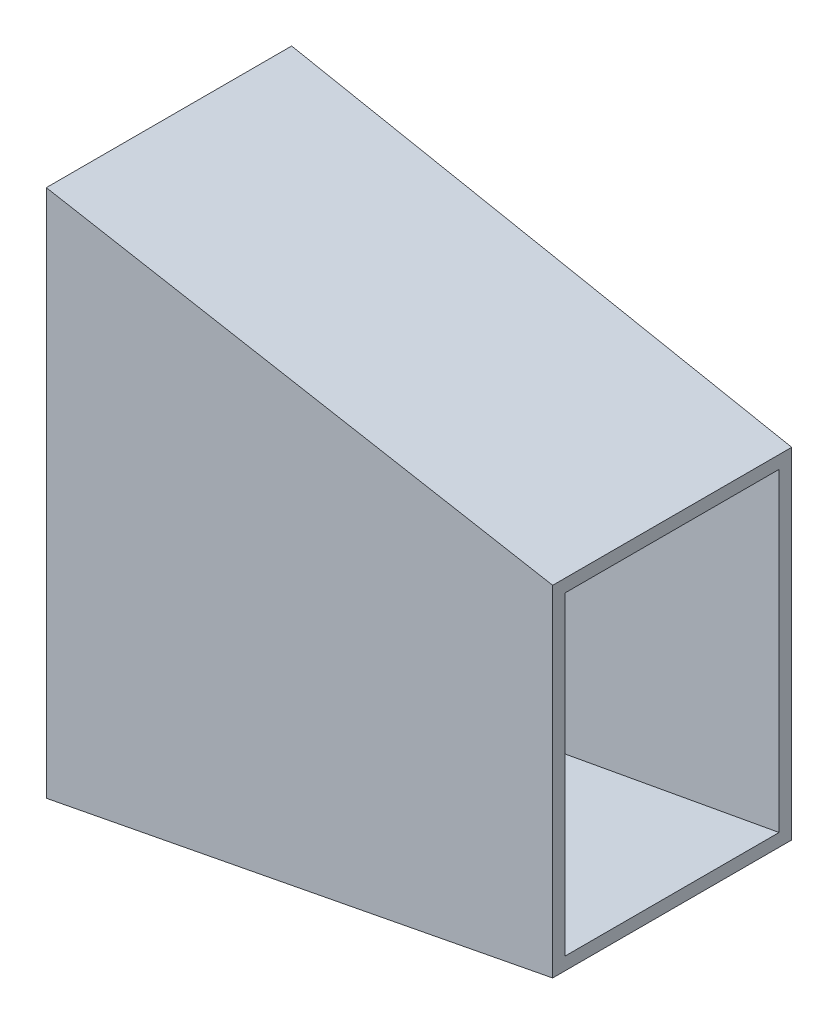
ISO-10303-21;
HEADER;
FILE_DESCRIPTION(('STEP AP214'),'2;1');
FILE_NAME('part.step','',(''),(''),'','','');
FILE_SCHEMA(('AUTOMOTIVE_DESIGN { 1 0 10303 214 1 1 1 1 }'));
ENDSEC;
DATA;
#1=APPLICATION_CONTEXT('core data for automotive mechanical design processes');
#2=APPLICATION_PROTOCOL_DEFINITION('international standard','automotive_design',2000,#1);
#3=PRODUCT_CONTEXT('',#1,'mechanical');
#4=PRODUCT('Part','Part','',(#3));
#5=PRODUCT_RELATED_PRODUCT_CATEGORY('part','',(#4));
#6=PRODUCT_DEFINITION_FORMATION('','',#4);
#7=PRODUCT_DEFINITION_CONTEXT('part definition',#1,'design');
#8=PRODUCT_DEFINITION('design','',#6,#7);
#9=PRODUCT_DEFINITION_SHAPE('','',#8);
#10=(LENGTH_UNIT() NAMED_UNIT(*) SI_UNIT(.MILLI.,.METRE.));
#11=(NAMED_UNIT(*) PLANE_ANGLE_UNIT() SI_UNIT($,.RADIAN.));
#12=(NAMED_UNIT(*) SI_UNIT($,.STERADIAN.) SOLID_ANGLE_UNIT());
#13=UNCERTAINTY_MEASURE_WITH_UNIT(LENGTH_MEASURE(1.E-05),#10,'distance_accuracy_value','');
#14=(GEOMETRIC_REPRESENTATION_CONTEXT(3) GLOBAL_UNCERTAINTY_ASSIGNED_CONTEXT((#13)) GLOBAL_UNIT_ASSIGNED_CONTEXT((#10,
#11,#12)) REPRESENTATION_CONTEXT('',''));
#15=CARTESIAN_POINT('',(0.,0.,0.));
#16=DIRECTION('',(0.,0.,1.));
#17=DIRECTION('',(1.,0.,0.));
#18=AXIS2_PLACEMENT_3D('',#15,#16,#17);
#19=CARTESIAN_POINT('',(800.000000000001,250.,-169.999999999994));
#20=DIRECTION('',(0.0062498779332704,0.,-0.999980469322186));
#21=DIRECTION('',(0.,-1.,0.));
#22=AXIS2_PLACEMENT_3D('',#19,#20,#21);
#23=PLANE('',#22);
#24=DIRECTION('',(-0.982853642700913,0.184285058006421,-0.00614283526688735));
#25=VECTOR('',#24,1.);
#26=CARTESIAN_POINT('',(400.000000000001,325.,-172.499999999997));
#27=LINE('',#26,#25);
#28=CARTESIAN_POINT('',(800.000000000001,250.,-169.999999999994));
#29=VERTEX_POINT('',#28);
#30=CARTESIAN_POINT('',(9.99999999999995,398.125,-174.9375));
#31=VERTEX_POINT('',#30);
#32=EDGE_CURVE('E411',#29,#31,#27,.T.);
#33=ORIENTED_EDGE('',*,*,#32,.T.);
#34=DIRECTION('',(0.,-1.,0.));
#35=VECTOR('',#34,1.);
#36=CARTESIAN_POINT('',(10.,250.,-174.9375));
#37=LINE('',#36,#35);
#38=CARTESIAN_POINT('',(10.,380.348525745124,-174.9375));
#39=VERTEX_POINT('',#38);
#40=EDGE_CURVE('E408',#31,#39,#37,.T.);
#41=ORIENTED_EDGE('',*,*,#40,.T.);
#42=CARTESIAN_POINT('',(10.,170.348525745124,-174.9375));
#43=VERTEX_POINT('',#42);
#44=EDGE_CURVE('E412',#39,#43,#37,.T.);
#45=ORIENTED_EDGE('',*,*,#44,.T.);
#46=CARTESIAN_POINT('',(10.,145.,-174.9375));
#47=VERTEX_POINT('',#46);
#48=EDGE_CURVE('E817',#43,#47,#37,.T.);
#49=ORIENTED_EDGE('',*,*,#48,.T.);
#50=CARTESIAN_POINT('',(10.,-145.,-174.9375));
#51=VERTEX_POINT('',#50);
#52=EDGE_CURVE('E816',#47,#51,#37,.T.);
#53=ORIENTED_EDGE('',*,*,#52,.T.);
#54=CARTESIAN_POINT('',(10.,-170.348525745124,-174.9375));
#55=VERTEX_POINT('',#54);
#56=EDGE_CURVE('E815',#51,#55,#37,.T.);
#57=ORIENTED_EDGE('',*,*,#56,.T.);
#58=CARTESIAN_POINT('',(10.,-380.348525745124,-174.9375));
#59=VERTEX_POINT('',#58);
#60=EDGE_CURVE('E800',#55,#59,#37,.T.);
#61=ORIENTED_EDGE('',*,*,#60,.T.);
#62=CARTESIAN_POINT('',(9.99999999999998,-398.125,-174.9375));
#63=VERTEX_POINT('',#62);
#64=EDGE_CURVE('E407',#59,#63,#37,.T.);
#65=ORIENTED_EDGE('',*,*,#64,.T.);
#66=DIRECTION('',(-0.982853642700913,-0.184285058006421,-0.00614283526688756));
#67=VECTOR('',#66,1.);
#68=CARTESIAN_POINT('',(400.000000000001,-325.,-172.499999999997));
#69=LINE('',#68,#67);
#70=CARTESIAN_POINT('',(800.000000000001,-250.,-169.999999999994));
#71=VERTEX_POINT('',#70);
#72=EDGE_CURVE('E417',#71,#63,#69,.T.);
#73=ORIENTED_EDGE('',*,*,#72,.F.);
#74=DIRECTION('',(0.,-1.,0.));
#75=VECTOR('',#74,1.);
#76=CARTESIAN_POINT('',(800.000000000001,0.,-169.999999999994));
#77=LINE('',#76,#75);
#78=EDGE_CURVE('E413',#29,#71,#77,.T.);
#79=ORIENTED_EDGE('',*,*,#78,.F.);
#80=EDGE_LOOP('',(#33,#41,#45,#49,#53,#57,#61,#65,#73,#79));
#81=FACE_BOUND('',#80,.T.);
#82=DIRECTION('',(0.,1.,0.));
#83=VECTOR('',#82,1.);
#84=CARTESIAN_POINT('',(431.474072205954,100.,-172.30328704871));
#85=LINE('',#84,#83);
#86=CARTESIAN_POINT('',(431.474072205954,-100.,-172.30328704871));
#87=VERTEX_POINT('',#86);
#88=CARTESIAN_POINT('',(431.474072205954,100.,-172.30328704871));
#89=VERTEX_POINT('',#88);
#90=EDGE_CURVE('E291',#87,#89,#85,.T.);
#91=ORIENTED_EDGE('',*,*,#90,.F.);
#92=DIRECTION('',(0.999980469322186,0.,0.00624987793327036));
#93=VECTOR('',#92,1.);
#94=CARTESIAN_POINT('',(371.475244046623,-100.,-172.678279724706));
#95=LINE('',#94,#93);
#96=CARTESIAN_POINT('',(371.475244046625,-100.,-172.678279724706));
#97=VERTEX_POINT('',#96);
#98=EDGE_CURVE('E288',#97,#87,#95,.T.);
#99=ORIENTED_EDGE('',*,*,#98,.F.);
#100=DIRECTION('',(0.,-1.,0.));
#101=VECTOR('',#100,1.);
#102=CARTESIAN_POINT('',(371.475244046623,100.,-172.678279724706));
#103=LINE('',#102,#101);
#104=CARTESIAN_POINT('',(371.475244046623,100.,-172.678279724706));
#105=VERTEX_POINT('',#104);
#106=EDGE_CURVE('E112',#105,#97,#103,.T.);
#107=ORIENTED_EDGE('',*,*,#106,.F.);
#108=DIRECTION('',(-0.999980469322186,0.,-0.00624987793327036));
#109=VECTOR('',#108,1.);
#110=CARTESIAN_POINT('',(371.475244046623,100.,-172.678279724706));
#111=LINE('',#110,#109);
#112=EDGE_CURVE('E107',#89,#105,#111,.T.);
#113=ORIENTED_EDGE('',*,*,#112,.F.);
#114=EDGE_LOOP('',(#91,#99,#107,#113));
#115=FACE_BOUND('',#114,.T.);
#116=ADVANCED_FACE('F92',(#81,#115),#23,.F.);
#117=CARTESIAN_POINT('',(0.,0.,0.));
#118=DIRECTION('',(-1.,0.,0.));
#119=DIRECTION('',(0.,0.,1.));
#120=AXIS2_PLACEMENT_3D('',#117,#118,#119);
#121=PLANE('',#120);
#122=DIRECTION('',(0.,-1.,0.));
#123=VECTOR('',#122,1.);
#124=CARTESIAN_POINT('',(0.,0.,-195.000390621185));
#125=LINE('',#124,#123);
#126=CARTESIAN_POINT('',(0.,420.348525745125,-195.000390621185));
#127=VERTEX_POINT('',#126);
#128=CARTESIAN_POINT('',(0.,-420.348525745125,-195.000390621185));
#129=VERTEX_POINT('',#128);
#130=EDGE_CURVE('E445',#127,#129,#125,.T.);
#131=ORIENTED_EDGE('',*,*,#130,.T.);
#132=DIRECTION('',(0.,0.,1.));
#133=VECTOR('',#132,1.);
#134=CARTESIAN_POINT('',(0.,-420.348525745124,5.66193389133556E-13));
#135=LINE('',#134,#133);
#136=CARTESIAN_POINT('',(0.,-420.348525745124,195.000390621185));
#137=VERTEX_POINT('',#136);
#138=EDGE_CURVE('E462',#129,#137,#135,.T.);
#139=ORIENTED_EDGE('',*,*,#138,.T.);
#140=DIRECTION('',(0.,1.,0.));
#141=VECTOR('',#140,1.);
#142=CARTESIAN_POINT('',(0.,0.,195.000390621185));
#143=LINE('',#142,#141);
#144=CARTESIAN_POINT('',(0.,420.348525745125,195.000390621185));
#145=VERTEX_POINT('',#144);
#146=EDGE_CURVE('E465',#137,#145,#143,.T.);
#147=ORIENTED_EDGE('',*,*,#146,.T.);
#148=DIRECTION('',(0.,0.,-1.));
#149=VECTOR('',#148,1.);
#150=CARTESIAN_POINT('',(0.,420.348525745125,5.66193389133559E-13));
#151=LINE('',#150,#149);
#152=EDGE_CURVE('E416',#145,#127,#151,.T.);
#153=ORIENTED_EDGE('',*,*,#152,.T.);
#154=EDGE_LOOP('',(#131,#139,#147,#153));
#155=FACE_BOUND('',#154,.T.);
#156=DIRECTION('',(0.,1.,0.));
#157=VECTOR('',#156,1.);
#158=CARTESIAN_POINT('',(0.,145.,-180.));
#159=LINE('',#158,#157);
#160=CARTESIAN_POINT('',(0.,-145.,-180.));
#161=VERTEX_POINT('',#160);
#162=CARTESIAN_POINT('',(0.,145.,-180.));
#163=VERTEX_POINT('',#162);
#164=EDGE_CURVE('E391',#161,#163,#159,.T.);
#165=ORIENTED_EDGE('',*,*,#164,.T.);
#166=DIRECTION('',(0.,0.,1.));
#167=VECTOR('',#166,1.);
#168=CARTESIAN_POINT('',(0.,145.,20.));
#169=LINE('',#168,#167);
#170=CARTESIAN_POINT('',(0.,145.,20.));
#171=VERTEX_POINT('',#170);
#172=EDGE_CURVE('E292',#163,#171,#169,.T.);
#173=ORIENTED_EDGE('',*,*,#172,.T.);
#174=DIRECTION('',(0.,-1.,0.));
#175=VECTOR('',#174,1.);
#176=CARTESIAN_POINT('',(0.,-145.,20.));
#177=LINE('',#176,#175);
#178=CARTESIAN_POINT('',(0.,-145.,20.));
#179=VERTEX_POINT('',#178);
#180=EDGE_CURVE('E295',#171,#179,#177,.T.);
#181=ORIENTED_EDGE('',*,*,#180,.T.);
#182=DIRECTION('',(0.,0.,-1.));
#183=VECTOR('',#182,1.);
#184=CARTESIAN_POINT('',(0.,-145.,-180.));
#185=LINE('',#184,#183);
#186=EDGE_CURVE('E388',#179,#161,#185,.T.);
#187=ORIENTED_EDGE('',*,*,#186,.T.);
#188=EDGE_LOOP('',(#165,#173,#181,#187));
#189=FACE_BOUND('',#188,.T.);
#190=DIRECTION('',(0.,0.,-1.));
#191=VECTOR('',#190,1.);
#192=CARTESIAN_POINT('',(0.,170.348525745124,-180.));
#193=LINE('',#192,#191);
#194=CARTESIAN_POINT('',(0.,170.348525745124,-40.));
#195=VERTEX_POINT('',#194);
#196=CARTESIAN_POINT('',(0.,170.348525745124,-180.));
#197=VERTEX_POINT('',#196);
#198=EDGE_CURVE('E340',#195,#197,#193,.T.);
#199=ORIENTED_EDGE('',*,*,#198,.T.);
#200=DIRECTION('',(0.,1.,0.));
#201=VECTOR('',#200,1.);
#202=CARTESIAN_POINT('',(0.,170.348525745124,-180.));
#203=LINE('',#202,#201);
#204=CARTESIAN_POINT('',(0.,380.348525745124,-180.));
#205=VERTEX_POINT('',#204);
#206=EDGE_CURVE('E352',#197,#205,#203,.T.);
#207=ORIENTED_EDGE('',*,*,#206,.T.);
#208=DIRECTION('',(0.,0.,1.));
#209=VECTOR('',#208,1.);
#210=CARTESIAN_POINT('',(0.,380.348525745124,-180.));
#211=LINE('',#210,#209);
#212=CARTESIAN_POINT('',(0.,380.348525745124,-39.9999999999996));
#213=VERTEX_POINT('',#212);
#214=EDGE_CURVE('E355',#205,#213,#211,.T.);
#215=ORIENTED_EDGE('',*,*,#214,.T.);
#216=DIRECTION('',(0.,-1.,0.));
#217=VECTOR('',#216,1.);
#218=CARTESIAN_POINT('',(0.,170.348525745124,-40.));
#219=LINE('',#218,#217);
#220=EDGE_CURVE('E359',#213,#195,#219,.T.);
#221=ORIENTED_EDGE('',*,*,#220,.T.);
#222=EDGE_LOOP('',(#199,#207,#215,#221));
#223=FACE_BOUND('',#222,.T.);
#224=DIRECTION('',(0.,0.,1.));
#225=VECTOR('',#224,1.);
#226=CARTESIAN_POINT('',(0.,-170.348525745124,-180.));
#227=LINE('',#226,#225);
#228=CARTESIAN_POINT('',(0.,-170.348525745124,-180.));
#229=VERTEX_POINT('',#228);
#230=CARTESIAN_POINT('',(0.,-170.348525745124,-40.0000000000001));
#231=VERTEX_POINT('',#230);
#232=EDGE_CURVE('E304',#229,#231,#227,.T.);
#233=ORIENTED_EDGE('',*,*,#232,.T.);
#234=DIRECTION('',(0.,-1.,0.));
#235=VECTOR('',#234,1.);
#236=CARTESIAN_POINT('',(0.,-170.348525745124,-40.0000000000001));
#237=LINE('',#236,#235);
#238=CARTESIAN_POINT('',(0.,-380.348525745124,-40.0000000000001));
#239=VERTEX_POINT('',#238);
#240=EDGE_CURVE('E314',#231,#239,#237,.T.);
#241=ORIENTED_EDGE('',*,*,#240,.T.);
#242=DIRECTION('',(0.,0.,-1.));
#243=VECTOR('',#242,1.);
#244=CARTESIAN_POINT('',(0.,-380.348525745124,-180.));
#245=LINE('',#244,#243);
#246=CARTESIAN_POINT('',(0.,-380.348525745124,-180.));
#247=VERTEX_POINT('',#246);
#248=EDGE_CURVE('E317',#239,#247,#245,.T.);
#249=ORIENTED_EDGE('',*,*,#248,.T.);
#250=DIRECTION('',(0.,1.,0.));
#251=VECTOR('',#250,1.);
#252=CARTESIAN_POINT('',(0.,-170.348525745124,-180.));
#253=LINE('',#252,#251);
#254=EDGE_CURVE('E321',#247,#229,#253,.T.);
#255=ORIENTED_EDGE('',*,*,#254,.T.);
#256=EDGE_LOOP('',(#233,#241,#249,#255));
#257=FACE_BOUND('',#256,.T.);
#258=ADVANCED_FACE('F469',(#155,#189,#223,#257),#121,.T.);
#259=CARTESIAN_POINT('',(800.124997558667,250.,-189.999609386438));
#260=DIRECTION('',(0.0062498779332704,0.,-0.999980469322186));
#261=DIRECTION('',(0.,-1.,0.));
#262=AXIS2_PLACEMENT_3D('',#259,#260,#261);
#263=PLANE('',#262);
#264=DIRECTION('',(0.,-1.,0.));
#265=VECTOR('',#264,1.);
#266=CARTESIAN_POINT('',(800.000000000001,0.,-190.00039062118));
#267=LINE('',#266,#265);
#268=CARTESIAN_POINT('',(800.000000000001,270.348525745125,-190.00039062118));
#269=VERTEX_POINT('',#268);
#270=CARTESIAN_POINT('',(800.000000000001,-270.348525745125,-190.00039062118));
#271=VERTEX_POINT('',#270);
#272=EDGE_CURVE('E100',#269,#271,#267,.T.);
#273=ORIENTED_EDGE('',*,*,#272,.T.);
#274=DIRECTION('',(-0.982853642700913,-0.184285058006421,-0.00614283526688731));
#275=VECTOR('',#274,1.);
#276=CARTESIAN_POINT('',(894.369004417796,-252.654337416788,-189.410584343568));
#277=LINE('',#276,#275);
#278=EDGE_CURVE('E437',#271,#129,#277,.T.);
#279=ORIENTED_EDGE('',*,*,#278,.T.);
#280=ORIENTED_EDGE('',*,*,#130,.F.);
#281=DIRECTION('',(-0.982853642700913,0.184285058006422,-0.00614283526688735));
#282=VECTOR('',#281,1.);
#283=CARTESIAN_POINT('',(805.859136865628,269.24993758282,-189.96377101577));
#284=LINE('',#283,#282);
#285=EDGE_CURVE('E441',#269,#127,#284,.T.);
#286=ORIENTED_EDGE('',*,*,#285,.F.);
#287=EDGE_LOOP('',(#273,#279,#280,#286));
#288=FACE_BOUND('',#287,.T.);
#289=ADVANCED_FACE('F475',(#288),#263,.T.);
#290=CARTESIAN_POINT('',(803.685770701005,-269.657443738686,-169.999999999994));
#291=DIRECTION('',(0.184288535050185,-0.982872186934322,0.));
#292=DIRECTION('',(0.,0.,1.));
#293=AXIS2_PLACEMENT_3D('',#290,#291,#292);
#294=PLANE('',#293);
#295=DIRECTION('',(0.,0.,1.));
#296=VECTOR('',#295,1.);
#297=CARTESIAN_POINT('',(800.,-270.348525745125,5.74703683335375E-12));
#298=LINE('',#297,#296);
#299=CARTESIAN_POINT('',(799.999999999999,-270.348525745125,190.000390621191));
#300=VERTEX_POINT('',#299);
#301=EDGE_CURVE('E440',#271,#300,#298,.T.);
#302=ORIENTED_EDGE('',*,*,#301,.T.);
#303=DIRECTION('',(-0.982853642700913,-0.184285058006421,0.0061428352668738));
#304=VECTOR('',#303,1.);
#305=CARTESIAN_POINT('',(805.859136865626,-269.249937582819,189.963771015781));
#306=LINE('',#305,#304);
#307=EDGE_CURVE('E446',#300,#137,#306,.T.);
#308=ORIENTED_EDGE('',*,*,#307,.T.);
#309=ORIENTED_EDGE('',*,*,#138,.F.);
#310=ORIENTED_EDGE('',*,*,#278,.F.);
#311=EDGE_LOOP('',(#302,#308,#309,#310));
#312=FACE_BOUND('',#311,.T.);
#313=ADVANCED_FACE('F481',(#312),#294,.T.);
#314=CARTESIAN_POINT('',(800.124997558664,-250.,189.999609386449));
#315=DIRECTION('',(0.00624987793325661,0.,0.999980469322186));
#316=DIRECTION('',(0.,1.,0.));
#317=AXIS2_PLACEMENT_3D('',#314,#315,#316);
#318=PLANE('',#317);
#319=DIRECTION('',(0.,1.,0.));
#320=VECTOR('',#319,1.);
#321=CARTESIAN_POINT('',(799.999999999999,0.,190.000390621191));
#322=LINE('',#321,#320);
#323=CARTESIAN_POINT('',(799.999999999999,270.348525745125,190.000390621191));
#324=VERTEX_POINT('',#323);
#325=EDGE_CURVE('E449',#300,#324,#322,.T.);
#326=ORIENTED_EDGE('',*,*,#325,.T.);
#327=DIRECTION('',(-0.982853642700913,0.184285058006422,0.00614283526687376));
#328=VECTOR('',#327,1.);
#329=CARTESIAN_POINT('',(894.369004417794,252.654337416788,189.41058434358));
#330=LINE('',#329,#328);
#331=EDGE_CURVE('E450',#324,#145,#330,.T.);
#332=ORIENTED_EDGE('',*,*,#331,.T.);
#333=ORIENTED_EDGE('',*,*,#146,.F.);
#334=ORIENTED_EDGE('',*,*,#307,.F.);
#335=EDGE_LOOP('',(#326,#332,#333,#334));
#336=FACE_BOUND('',#335,.T.);
#337=ADVANCED_FACE('F484',(#336),#318,.T.);
#338=CARTESIAN_POINT('',(803.685770701003,269.657443738686,170.000000000006));
#339=DIRECTION('',(0.184288535050186,0.982872186934322,0.));
#340=DIRECTION('',(0.,0.,-1.));
#341=AXIS2_PLACEMENT_3D('',#338,#339,#340);
#342=PLANE('',#341);
#343=DIRECTION('',(0.,0.,-1.));
#344=VECTOR('',#343,1.);
#345=CARTESIAN_POINT('',(800.,270.348525745125,5.74703683335375E-12));
#346=LINE('',#345,#344);
#347=EDGE_CURVE('E444',#324,#269,#346,.T.);
#348=ORIENTED_EDGE('',*,*,#347,.T.);
#349=ORIENTED_EDGE('',*,*,#285,.T.);
#350=ORIENTED_EDGE('',*,*,#152,.F.);
#351=ORIENTED_EDGE('',*,*,#331,.F.);
#352=EDGE_LOOP('',(#348,#349,#350,#351));
#353=FACE_BOUND('',#352,.T.);
#354=ADVANCED_FACE('F94',(#353),#342,.T.);
#355=CARTESIAN_POINT('',(800.,0.,5.74703683335375E-12));
#356=DIRECTION('',(-1.,0.,0.));
#357=DIRECTION('',(0.,0.,1.));
#358=AXIS2_PLACEMENT_3D('',#355,#356,#357);
#359=PLANE('',#358);
#360=DIRECTION('',(0.,1.,0.));
#361=VECTOR('',#360,1.);
#362=CARTESIAN_POINT('',(799.999999999999,0.,170.000000000006));
#363=LINE('',#362,#361);
#364=CARTESIAN_POINT('',(799.999999999999,-250.,170.000000000006));
#365=VERTEX_POINT('',#364);
#366=CARTESIAN_POINT('',(799.999999999999,250.,170.000000000006));
#367=VERTEX_POINT('',#366);
#368=EDGE_CURVE('E426',#365,#367,#363,.T.);
#369=ORIENTED_EDGE('',*,*,#368,.T.);
#370=DIRECTION('',(0.,0.,-1.));
#371=VECTOR('',#370,1.);
#372=CARTESIAN_POINT('',(800.,250.,5.55111512312578E-12));
#373=LINE('',#372,#371);
#374=EDGE_CURVE('E432',#367,#29,#373,.T.);
#375=ORIENTED_EDGE('',*,*,#374,.T.);
#376=ORIENTED_EDGE('',*,*,#78,.T.);
#377=DIRECTION('',(0.,0.,1.));
#378=VECTOR('',#377,1.);
#379=CARTESIAN_POINT('',(800.,-250.,5.60662627435704E-12));
#380=LINE('',#379,#378);
#381=EDGE_CURVE('E420',#71,#365,#380,.T.);
#382=ORIENTED_EDGE('',*,*,#381,.T.);
#383=EDGE_LOOP('',(#369,#375,#376,#382));
#384=FACE_BOUND('',#383,.T.);
#385=ORIENTED_EDGE('',*,*,#347,.F.);
#386=ORIENTED_EDGE('',*,*,#325,.F.);
#387=ORIENTED_EDGE('',*,*,#301,.F.);
#388=ORIENTED_EDGE('',*,*,#272,.F.);
#389=EDGE_LOOP('',(#385,#386,#387,#388));
#390=FACE_BOUND('',#389,.T.);
#391=ADVANCED_FACE('F479',(#384,#390),#359,.F.);
#392=CARTESIAN_POINT('',(800.000000000001,-250.,-169.999999999994));
#393=DIRECTION('',(0.184288535050185,-0.982872186934322,0.));
#394=DIRECTION('',(0.,0.,1.));
#395=AXIS2_PLACEMENT_3D('',#392,#393,#394);
#396=PLANE('',#395);
#397=ORIENTED_EDGE('',*,*,#72,.T.);
#398=DIRECTION('',(0.,0.,1.));
#399=VECTOR('',#398,1.);
#400=CARTESIAN_POINT('',(10.,-398.125,-169.999999999994));
#401=LINE('',#400,#399);
#402=CARTESIAN_POINT('',(9.99999999999998,-398.125,174.9375));
#403=VERTEX_POINT('',#402);
#404=EDGE_CURVE('E404',#63,#403,#401,.T.);
#405=ORIENTED_EDGE('',*,*,#404,.T.);
#406=DIRECTION('',(-0.982853642700913,-0.184285058006421,0.0061428352668738));
#407=VECTOR('',#406,1.);
#408=CARTESIAN_POINT('',(399.999999999999,-325.,172.500000000003));
#409=LINE('',#408,#407);
#410=EDGE_CURVE('E423',#365,#403,#409,.T.);
#411=ORIENTED_EDGE('',*,*,#410,.F.);
#412=ORIENTED_EDGE('',*,*,#381,.F.);
#413=EDGE_LOOP('',(#397,#405,#411,#412));
#414=FACE_BOUND('',#413,.T.);
#415=ADVANCED_FACE('F502',(#414),#396,.F.);
#416=CARTESIAN_POINT('',(799.999999999999,-250.,170.000000000006));
#417=DIRECTION('',(0.00624987793325661,0.,0.999980469322186));
#418=DIRECTION('',(0.,1.,0.));
#419=AXIS2_PLACEMENT_3D('',#416,#417,#418);
#420=PLANE('',#419);
#421=ORIENTED_EDGE('',*,*,#410,.T.);
#422=DIRECTION('',(0.,1.,0.));
#423=VECTOR('',#422,1.);
#424=CARTESIAN_POINT('',(10.,-250.,174.9375));
#425=LINE('',#424,#423);
#426=CARTESIAN_POINT('',(9.99999999999998,398.125,174.9375));
#427=VERTEX_POINT('',#426);
#428=EDGE_CURVE('E335',#403,#427,#425,.T.);
#429=ORIENTED_EDGE('',*,*,#428,.T.);
#430=DIRECTION('',(-0.982853642700913,0.184285058006422,0.006142835266874));
#431=VECTOR('',#430,1.);
#432=CARTESIAN_POINT('',(399.999999999999,325.,172.500000000003));
#433=LINE('',#432,#431);
#434=EDGE_CURVE('E429',#367,#427,#433,.T.);
#435=ORIENTED_EDGE('',*,*,#434,.F.);
#436=ORIENTED_EDGE('',*,*,#368,.F.);
#437=EDGE_LOOP('',(#421,#429,#435,#436));
#438=FACE_BOUND('',#437,.T.);
#439=ADVANCED_FACE('F505',(#438),#420,.F.);
#440=CARTESIAN_POINT('',(799.999999999999,250.,170.000000000006));
#441=DIRECTION('',(0.184288535050186,0.982872186934322,0.));
#442=DIRECTION('',(0.,0.,-1.));
#443=AXIS2_PLACEMENT_3D('',#440,#441,#442);
#444=PLANE('',#443);
#445=ORIENTED_EDGE('',*,*,#434,.T.);
#446=DIRECTION('',(0.,0.,-1.));
#447=VECTOR('',#446,1.);
#448=CARTESIAN_POINT('',(10.,398.125,170.000000000006));
#449=LINE('',#448,#447);
#450=EDGE_CURVE('E12',#427,#31,#449,.T.);
#451=ORIENTED_EDGE('',*,*,#450,.T.);
#452=ORIENTED_EDGE('',*,*,#32,.F.);
#453=ORIENTED_EDGE('',*,*,#374,.F.);
#454=EDGE_LOOP('',(#445,#451,#452,#453));
#455=FACE_BOUND('',#454,.T.);
#456=ADVANCED_FACE('F509',(#455),#444,.F.);
#457=CARTESIAN_POINT('',(10.,0.,0.));
#458=DIRECTION('',(1.,0.,0.));
#459=DIRECTION('',(0.,0.,-1.));
#460=AXIS2_PLACEMENT_3D('',#457,#458,#459);
#461=PLANE('',#460);
#462=DIRECTION('',(0.,0.,-1.));
#463=VECTOR('',#462,1.);
#464=CARTESIAN_POINT('',(10.,-380.348525745124,-180.));
#465=LINE('',#464,#463);
#466=CARTESIAN_POINT('',(10.,-380.348525745124,-40.0000000000001));
#467=VERTEX_POINT('',#466);
#468=EDGE_CURVE('E305',#467,#59,#465,.T.);
#469=ORIENTED_EDGE('',*,*,#468,.F.);
#470=DIRECTION('',(0.,-1.,0.));
#471=VECTOR('',#470,1.);
#472=CARTESIAN_POINT('',(10.,-170.348525745124,-40.0000000000001));
#473=LINE('',#472,#471);
#474=CARTESIAN_POINT('',(10.,-170.348525745124,-40.0000000000001));
#475=VERTEX_POINT('',#474);
#476=EDGE_CURVE('E301',#475,#467,#473,.T.);
#477=ORIENTED_EDGE('',*,*,#476,.F.);
#478=DIRECTION('',(0.,0.,1.));
#479=VECTOR('',#478,1.);
#480=CARTESIAN_POINT('',(10.,-170.348525745124,-180.));
#481=LINE('',#480,#479);
#482=EDGE_CURVE('E310',#55,#475,#481,.T.);
#483=ORIENTED_EDGE('',*,*,#482,.F.);
#484=ORIENTED_EDGE('',*,*,#56,.F.);
#485=DIRECTION('',(0.,0.,-1.));
#486=VECTOR('',#485,1.);
#487=CARTESIAN_POINT('',(10.,-145.,-180.));
#488=LINE('',#487,#486);
#489=CARTESIAN_POINT('',(10.,-145.,20.));
#490=VERTEX_POINT('',#489);
#491=EDGE_CURVE('E380',#490,#51,#488,.T.);
#492=ORIENTED_EDGE('',*,*,#491,.F.);
#493=DIRECTION('',(0.,-1.,0.));
#494=VECTOR('',#493,1.);
#495=CARTESIAN_POINT('',(10.,-145.,20.));
#496=LINE('',#495,#494);
#497=CARTESIAN_POINT('',(10.,145.,20.));
#498=VERTEX_POINT('',#497);
#499=EDGE_CURVE('E375',#498,#490,#496,.T.);
#500=ORIENTED_EDGE('',*,*,#499,.F.);
#501=DIRECTION('',(0.,0.,1.));
#502=VECTOR('',#501,1.);
#503=CARTESIAN_POINT('',(10.,145.,20.));
#504=LINE('',#503,#502);
#505=EDGE_CURVE('E376',#47,#498,#504,.T.);
#506=ORIENTED_EDGE('',*,*,#505,.F.);
#507=ORIENTED_EDGE('',*,*,#48,.F.);
#508=DIRECTION('',(0.,0.,-1.));
#509=VECTOR('',#508,1.);
#510=CARTESIAN_POINT('',(10.,170.348525745124,-180.));
#511=LINE('',#510,#509);
#512=CARTESIAN_POINT('',(10.,170.348525745124,-40.));
#513=VERTEX_POINT('',#512);
#514=EDGE_CURVE('E348',#513,#43,#511,.T.);
#515=ORIENTED_EDGE('',*,*,#514,.F.);
#516=DIRECTION('',(0.,-1.,0.));
#517=VECTOR('',#516,1.);
#518=CARTESIAN_POINT('',(10.,170.348525745124,-40.));
#519=LINE('',#518,#517);
#520=CARTESIAN_POINT('',(10.,380.348525745124,-39.9999999999996));
#521=VERTEX_POINT('',#520);
#522=EDGE_CURVE('E344',#521,#513,#519,.T.);
#523=ORIENTED_EDGE('',*,*,#522,.F.);
#524=DIRECTION('',(0.,0.,1.));
#525=VECTOR('',#524,1.);
#526=CARTESIAN_POINT('',(10.,380.348525745124,-180.));
#527=LINE('',#526,#525);
#528=EDGE_CURVE('E339',#39,#521,#527,.T.);
#529=ORIENTED_EDGE('',*,*,#528,.F.);
#530=ORIENTED_EDGE('',*,*,#40,.F.);
#531=ORIENTED_EDGE('',*,*,#450,.F.);
#532=ORIENTED_EDGE('',*,*,#428,.F.);
#533=ORIENTED_EDGE('',*,*,#404,.F.);
#534=ORIENTED_EDGE('',*,*,#64,.F.);
#535=EDGE_LOOP('',(#469,#477,#483,#484,#492,#500,#506,#507,#515,#523,#529,#530,#531,#532,#533,#534));
#536=FACE_BOUND('',#535,.T.);
#537=ADVANCED_FACE('F500',(#536),#461,.T.);
#538=CARTESIAN_POINT('',(10.,145.,20.));
#539=DIRECTION('',(0.,-1.,0.));
#540=DIRECTION('',(0.,0.,-1.));
#541=AXIS2_PLACEMENT_3D('',#538,#539,#540);
#542=PLANE('',#541);
#543=ORIENTED_EDGE('',*,*,#172,.F.);
#544=DIRECTION('',(-1.,0.,0.));
#545=VECTOR('',#544,1.);
#546=CARTESIAN_POINT('',(10.,145.,-180.));
#547=LINE('',#546,#545);
#548=CARTESIAN_POINT('',(10.,145.,-180.));
#549=VERTEX_POINT('',#548);
#550=EDGE_CURVE('E384',#549,#163,#547,.T.);
#551=ORIENTED_EDGE('',*,*,#550,.F.);
#552=EDGE_CURVE('E372',#549,#47,#504,.T.);
#553=ORIENTED_EDGE('',*,*,#552,.T.);
#554=ORIENTED_EDGE('',*,*,#505,.T.);
#555=DIRECTION('',(-1.,0.,0.));
#556=VECTOR('',#555,1.);
#557=CARTESIAN_POINT('',(10.,145.,20.));
#558=LINE('',#557,#556);
#559=EDGE_CURVE('E356',#498,#171,#558,.T.);
#560=ORIENTED_EDGE('',*,*,#559,.T.);
#561=EDGE_LOOP('',(#543,#551,#553,#554,#560));
#562=FACE_BOUND('',#561,.T.);
#563=ADVANCED_FACE('F582',(#562),#542,.T.);
#564=CARTESIAN_POINT('',(10.,-145.,20.));
#565=DIRECTION('',(0.,0.,-1.));
#566=DIRECTION('',(-1.,0.,0.));
#567=AXIS2_PLACEMENT_3D('',#564,#565,#566);
#568=PLANE('',#567);
#569=ORIENTED_EDGE('',*,*,#180,.F.);
#570=ORIENTED_EDGE('',*,*,#559,.F.);
#571=ORIENTED_EDGE('',*,*,#499,.T.);
#572=DIRECTION('',(-1.,0.,0.));
#573=VECTOR('',#572,1.);
#574=CARTESIAN_POINT('',(10.,-145.,20.));
#575=LINE('',#574,#573);
#576=EDGE_CURVE('E398',#490,#179,#575,.T.);
#577=ORIENTED_EDGE('',*,*,#576,.T.);
#578=EDGE_LOOP('',(#569,#570,#571,#577));
#579=FACE_BOUND('',#578,.T.);
#580=ADVANCED_FACE('F591',(#579),#568,.T.);
#581=CARTESIAN_POINT('',(10.,-145.,-180.));
#582=DIRECTION('',(0.,1.,0.));
#583=DIRECTION('',(0.,0.,1.));
#584=AXIS2_PLACEMENT_3D('',#581,#582,#583);
#585=PLANE('',#584);
#586=ORIENTED_EDGE('',*,*,#186,.F.);
#587=ORIENTED_EDGE('',*,*,#576,.F.);
#588=ORIENTED_EDGE('',*,*,#491,.T.);
#589=CARTESIAN_POINT('',(10.,-145.,-180.));
#590=VERTEX_POINT('',#589);
#591=EDGE_CURVE('E379',#51,#590,#488,.T.);
#592=ORIENTED_EDGE('',*,*,#591,.T.);
#593=DIRECTION('',(-1.,0.,0.));
#594=VECTOR('',#593,1.);
#595=CARTESIAN_POINT('',(10.,-145.,-180.));
#596=LINE('',#595,#594);
#597=EDGE_CURVE('E396',#590,#161,#596,.T.);
#598=ORIENTED_EDGE('',*,*,#597,.T.);
#599=EDGE_LOOP('',(#586,#587,#588,#592,#598));
#600=FACE_BOUND('',#599,.T.);
#601=ADVANCED_FACE('F600',(#600),#585,.T.);
#602=CARTESIAN_POINT('',(10.,145.,-180.));
#603=DIRECTION('',(0.,0.,1.));
#604=DIRECTION('',(1.,0.,0.));
#605=AXIS2_PLACEMENT_3D('',#602,#603,#604);
#606=PLANE('',#605);
#607=ORIENTED_EDGE('',*,*,#164,.F.);
#608=ORIENTED_EDGE('',*,*,#597,.F.);
#609=DIRECTION('',(0.,1.,0.));
#610=VECTOR('',#609,1.);
#611=CARTESIAN_POINT('',(10.,145.,-180.));
#612=LINE('',#611,#610);
#613=EDGE_CURVE('E383',#590,#549,#612,.T.);
#614=ORIENTED_EDGE('',*,*,#613,.T.);
#615=ORIENTED_EDGE('',*,*,#550,.T.);
#616=EDGE_LOOP('',(#607,#608,#614,#615));
#617=FACE_BOUND('',#616,.T.);
#618=ADVANCED_FACE('F610',(#617),#606,.T.);
#619=CARTESIAN_POINT('',(10.,0.,0.));
#620=DIRECTION('',(-1.,0.,0.));
#621=DIRECTION('',(0.,0.,1.));
#622=AXIS2_PLACEMENT_3D('',#619,#620,#621);
#623=PLANE('',#622);
#624=ORIENTED_EDGE('',*,*,#552,.F.);
#625=ORIENTED_EDGE('',*,*,#613,.F.);
#626=ORIENTED_EDGE('',*,*,#591,.F.);
#627=ORIENTED_EDGE('',*,*,#52,.F.);
#628=EDGE_LOOP('',(#624,#625,#626,#627));
#629=FACE_BOUND('',#628,.T.);
#630=ADVANCED_FACE('F620',(#629),#623,.T.);
#631=CARTESIAN_POINT('',(10.,0.,0.));
#632=DIRECTION('',(1.,0.,0.));
#633=DIRECTION('',(0.,0.,-1.));
#634=AXIS2_PLACEMENT_3D('',#631,#632,#633);
#635=PLANE('',#634);
#636=CARTESIAN_POINT('',(10.,380.348525745124,-180.));
#637=VERTEX_POINT('',#636);
#638=EDGE_CURVE('E341',#637,#39,#527,.T.);
#639=ORIENTED_EDGE('',*,*,#638,.F.);
#640=DIRECTION('',(0.,1.,0.));
#641=VECTOR('',#640,1.);
#642=CARTESIAN_POINT('',(10.,170.348525745124,-180.));
#643=LINE('',#642,#641);
#644=CARTESIAN_POINT('',(10.,170.348525745124,-180.));
#645=VERTEX_POINT('',#644);
#646=EDGE_CURVE('E336',#645,#637,#643,.T.);
#647=ORIENTED_EDGE('',*,*,#646,.F.);
#648=EDGE_CURVE('E347',#43,#645,#511,.T.);
#649=ORIENTED_EDGE('',*,*,#648,.F.);
#650=ORIENTED_EDGE('',*,*,#44,.F.);
#651=EDGE_LOOP('',(#639,#647,#649,#650));
#652=FACE_BOUND('',#651,.T.);
#653=ADVANCED_FACE('F630',(#652),#635,.F.);
#654=CARTESIAN_POINT('',(10.,170.348525745124,-180.));
#655=DIRECTION('',(0.,0.,1.));
#656=DIRECTION('',(0.,-1.,0.));
#657=AXIS2_PLACEMENT_3D('',#654,#655,#656);
#658=PLANE('',#657);
#659=ORIENTED_EDGE('',*,*,#206,.F.);
#660=DIRECTION('',(-1.,0.,0.));
#661=VECTOR('',#660,1.);
#662=CARTESIAN_POINT('',(10.,170.348525745124,-180.));
#663=LINE('',#662,#661);
#664=EDGE_CURVE('E351',#645,#197,#663,.T.);
#665=ORIENTED_EDGE('',*,*,#664,.F.);
#666=ORIENTED_EDGE('',*,*,#646,.T.);
#667=DIRECTION('',(-1.,0.,0.));
#668=VECTOR('',#667,1.);
#669=CARTESIAN_POINT('',(10.,380.348525745124,-180.));
#670=LINE('',#669,#668);
#671=EDGE_CURVE('E318',#637,#205,#670,.T.);
#672=ORIENTED_EDGE('',*,*,#671,.T.);
#673=EDGE_LOOP('',(#659,#665,#666,#672));
#674=FACE_BOUND('',#673,.T.);
#675=ADVANCED_FACE('F640',(#674),#658,.T.);
#676=CARTESIAN_POINT('',(10.,380.348525745124,-180.));
#677=DIRECTION('',(0.,-1.,0.));
#678=DIRECTION('',(0.,0.,-1.));
#679=AXIS2_PLACEMENT_3D('',#676,#677,#678);
#680=PLANE('',#679);
#681=ORIENTED_EDGE('',*,*,#214,.F.);
#682=ORIENTED_EDGE('',*,*,#671,.F.);
#683=ORIENTED_EDGE('',*,*,#638,.T.);
#684=ORIENTED_EDGE('',*,*,#528,.T.);
#685=DIRECTION('',(-1.,0.,0.));
#686=VECTOR('',#685,1.);
#687=CARTESIAN_POINT('',(10.,380.348525745124,-39.9999999999996));
#688=LINE('',#687,#686);
#689=EDGE_CURVE('E368',#521,#213,#688,.T.);
#690=ORIENTED_EDGE('',*,*,#689,.T.);
#691=EDGE_LOOP('',(#681,#682,#683,#684,#690));
#692=FACE_BOUND('',#691,.T.);
#693=ADVANCED_FACE('F650',(#692),#680,.T.);
#694=CARTESIAN_POINT('',(10.,170.348525745124,-40.));
#695=DIRECTION('',(0.,0.,-1.));
#696=DIRECTION('',(0.,1.,0.));
#697=AXIS2_PLACEMENT_3D('',#694,#695,#696);
#698=PLANE('',#697);
#699=ORIENTED_EDGE('',*,*,#220,.F.);
#700=ORIENTED_EDGE('',*,*,#689,.F.);
#701=ORIENTED_EDGE('',*,*,#522,.T.);
#702=DIRECTION('',(-1.,0.,0.));
#703=VECTOR('',#702,1.);
#704=CARTESIAN_POINT('',(10.,170.348525745124,-40.));
#705=LINE('',#704,#703);
#706=EDGE_CURVE('E366',#513,#195,#705,.T.);
#707=ORIENTED_EDGE('',*,*,#706,.T.);
#708=EDGE_LOOP('',(#699,#700,#701,#707));
#709=FACE_BOUND('',#708,.T.);
#710=ADVANCED_FACE('F660',(#709),#698,.T.);
#711=CARTESIAN_POINT('',(10.,170.348525745124,-180.));
#712=DIRECTION('',(0.,1.,0.));
#713=DIRECTION('',(0.,0.,1.));
#714=AXIS2_PLACEMENT_3D('',#711,#712,#713);
#715=PLANE('',#714);
#716=ORIENTED_EDGE('',*,*,#198,.F.);
#717=ORIENTED_EDGE('',*,*,#706,.F.);
#718=ORIENTED_EDGE('',*,*,#514,.T.);
#719=ORIENTED_EDGE('',*,*,#648,.T.);
#720=ORIENTED_EDGE('',*,*,#664,.T.);
#721=EDGE_LOOP('',(#716,#717,#718,#719,#720));
#722=FACE_BOUND('',#721,.T.);
#723=ADVANCED_FACE('F670',(#722),#715,.T.);
#724=CARTESIAN_POINT('',(10.,-170.348525745124,-40.0000000000001));
#725=DIRECTION('',(0.,0.,-1.));
#726=DIRECTION('',(0.,1.,0.));
#727=AXIS2_PLACEMENT_3D('',#724,#725,#726);
#728=PLANE('',#727);
#729=ORIENTED_EDGE('',*,*,#240,.F.);
#730=DIRECTION('',(-1.,0.,0.));
#731=VECTOR('',#730,1.);
#732=CARTESIAN_POINT('',(10.,-170.348525745124,-40.0000000000001));
#733=LINE('',#732,#731);
#734=EDGE_CURVE('E313',#475,#231,#733,.T.);
#735=ORIENTED_EDGE('',*,*,#734,.F.);
#736=ORIENTED_EDGE('',*,*,#476,.T.);
#737=DIRECTION('',(-1.,0.,0.));
#738=VECTOR('',#737,1.);
#739=CARTESIAN_POINT('',(10.,-380.348525745124,-40.0000000000001));
#740=LINE('',#739,#738);
#741=EDGE_CURVE('E332',#467,#239,#740,.T.);
#742=ORIENTED_EDGE('',*,*,#741,.T.);
#743=EDGE_LOOP('',(#729,#735,#736,#742));
#744=FACE_BOUND('',#743,.T.);
#745=ADVANCED_FACE('F680',(#744),#728,.T.);
#746=CARTESIAN_POINT('',(10.,-380.348525745124,-180.));
#747=DIRECTION('',(0.,1.,0.));
#748=DIRECTION('',(0.,0.,1.));
#749=AXIS2_PLACEMENT_3D('',#746,#747,#748);
#750=PLANE('',#749);
#751=ORIENTED_EDGE('',*,*,#248,.F.);
#752=ORIENTED_EDGE('',*,*,#741,.F.);
#753=ORIENTED_EDGE('',*,*,#468,.T.);
#754=CARTESIAN_POINT('',(10.,-380.348525745124,-180.));
#755=VERTEX_POINT('',#754);
#756=EDGE_CURVE('E303',#59,#755,#465,.T.);
#757=ORIENTED_EDGE('',*,*,#756,.T.);
#758=DIRECTION('',(-1.,0.,0.));
#759=VECTOR('',#758,1.);
#760=CARTESIAN_POINT('',(10.,-380.348525745124,-180.));
#761=LINE('',#760,#759);
#762=EDGE_CURVE('E330',#755,#247,#761,.T.);
#763=ORIENTED_EDGE('',*,*,#762,.T.);
#764=EDGE_LOOP('',(#751,#752,#753,#757,#763));
#765=FACE_BOUND('',#764,.T.);
#766=ADVANCED_FACE('F690',(#765),#750,.T.);
#767=CARTESIAN_POINT('',(10.,-170.348525745124,-180.));
#768=DIRECTION('',(0.,0.,1.));
#769=DIRECTION('',(0.,-1.,0.));
#770=AXIS2_PLACEMENT_3D('',#767,#768,#769);
#771=PLANE('',#770);
#772=ORIENTED_EDGE('',*,*,#254,.F.);
#773=ORIENTED_EDGE('',*,*,#762,.F.);
#774=DIRECTION('',(0.,1.,0.));
#775=VECTOR('',#774,1.);
#776=CARTESIAN_POINT('',(10.,-170.348525745124,-180.));
#777=LINE('',#776,#775);
#778=CARTESIAN_POINT('',(10.,-170.348525745124,-180.));
#779=VERTEX_POINT('',#778);
#780=EDGE_CURVE('E308',#755,#779,#777,.T.);
#781=ORIENTED_EDGE('',*,*,#780,.T.);
#782=DIRECTION('',(-1.,0.,0.));
#783=VECTOR('',#782,1.);
#784=CARTESIAN_POINT('',(10.,-170.348525745124,-180.));
#785=LINE('',#784,#783);
#786=EDGE_CURVE('E328',#779,#229,#785,.T.);
#787=ORIENTED_EDGE('',*,*,#786,.T.);
#788=EDGE_LOOP('',(#772,#773,#781,#787));
#789=FACE_BOUND('',#788,.T.);
#790=ADVANCED_FACE('F700',(#789),#771,.T.);
#791=CARTESIAN_POINT('',(10.,-170.348525745124,-180.));
#792=DIRECTION('',(0.,-1.,0.));
#793=DIRECTION('',(0.,0.,-1.));
#794=AXIS2_PLACEMENT_3D('',#791,#792,#793);
#795=PLANE('',#794);
#796=ORIENTED_EDGE('',*,*,#232,.F.);
#797=ORIENTED_EDGE('',*,*,#786,.F.);
#798=EDGE_CURVE('E311',#779,#55,#481,.T.);
#799=ORIENTED_EDGE('',*,*,#798,.T.);
#800=ORIENTED_EDGE('',*,*,#482,.T.);
#801=ORIENTED_EDGE('',*,*,#734,.T.);
#802=EDGE_LOOP('',(#796,#797,#799,#800,#801));
#803=FACE_BOUND('',#802,.T.);
#804=ADVANCED_FACE('F710',(#803),#795,.T.);
#805=CARTESIAN_POINT('',(10.,0.,0.));
#806=DIRECTION('',(-1.,0.,0.));
#807=DIRECTION('',(0.,0.,1.));
#808=AXIS2_PLACEMENT_3D('',#805,#806,#807);
#809=PLANE('',#808);
#810=ORIENTED_EDGE('',*,*,#798,.F.);
#811=ORIENTED_EDGE('',*,*,#780,.F.);
#812=ORIENTED_EDGE('',*,*,#756,.F.);
#813=ORIENTED_EDGE('',*,*,#60,.F.);
#814=EDGE_LOOP('',(#810,#811,#812,#813));
#815=FACE_BOUND('',#814,.T.);
#816=ADVANCED_FACE('F720',(#815),#809,.T.);
#817=CARTESIAN_POINT('',(430.536590515964,100.,-22.3062166503818));
#818=DIRECTION('',(-0.999980469322186,0.,-0.0062498779332704));
#819=DIRECTION('',(-0.0062498779332704,0.,0.999980469322186));
#820=AXIS2_PLACEMENT_3D('',#817,#818,#819);
#821=PLANE('',#820);
#822=ORIENTED_EDGE('',*,*,#90,.T.);
#823=DIRECTION('',(0.0062498779332704,0.,-0.999980469322186));
#824=VECTOR('',#823,1.);
#825=CARTESIAN_POINT('',(430.536590515964,100.,-22.3062166503818));
#826=LINE('',#825,#824);
#827=CARTESIAN_POINT('',(430.536590515964,100.,-22.3062166503818));
#828=VERTEX_POINT('',#827);
#829=EDGE_CURVE('E272',#828,#89,#826,.T.);
#830=ORIENTED_EDGE('',*,*,#829,.F.);
#831=DIRECTION('',(0.,1.,0.));
#832=VECTOR('',#831,1.);
#833=CARTESIAN_POINT('',(430.536590515964,100.,-22.3062166503818));
#834=LINE('',#833,#832);
#835=CARTESIAN_POINT('',(430.536590515964,-100.,-22.3062166503818));
#836=VERTEX_POINT('',#835);
#837=EDGE_CURVE('E279',#836,#828,#834,.T.);
#838=ORIENTED_EDGE('',*,*,#837,.F.);
#839=DIRECTION('',(0.0062498779332704,0.,-0.999980469322186));
#840=VECTOR('',#839,1.);
#841=CARTESIAN_POINT('',(430.536590515964,-100.,-22.3062166503818));
#842=LINE('',#841,#840);
#843=EDGE_CURVE('E785',#836,#87,#842,.T.);
#844=ORIENTED_EDGE('',*,*,#843,.T.);
#845=EDGE_LOOP('',(#822,#830,#838,#844));
#846=FACE_BOUND('',#845,.T.);
#847=ADVANCED_FACE('F290',(#846),#821,.F.);
#848=CARTESIAN_POINT('',(370.537762356632,100.,-22.6812093263781));
#849=DIRECTION('',(0.,-1.,0.));
#850=DIRECTION('',(0.,0.,-1.));
#851=AXIS2_PLACEMENT_3D('',#848,#849,#850);
#852=PLANE('',#851);
#853=ORIENTED_EDGE('',*,*,#112,.T.);
#854=DIRECTION('',(0.0062498779332704,0.,-0.999980469322186));
#855=VECTOR('',#854,1.);
#856=CARTESIAN_POINT('',(370.537762356632,100.,-22.6812093263781));
#857=LINE('',#856,#855);
#858=CARTESIAN_POINT('',(370.537762356632,100.,-22.6812093263781));
#859=VERTEX_POINT('',#858);
#860=EDGE_CURVE('E275',#859,#105,#857,.T.);
#861=ORIENTED_EDGE('',*,*,#860,.F.);
#862=DIRECTION('',(-0.999980469322186,0.,-0.00624987793327036));
#863=VECTOR('',#862,1.);
#864=CARTESIAN_POINT('',(370.537762356632,100.,-22.6812093263781));
#865=LINE('',#864,#863);
#866=EDGE_CURVE('E268',#828,#859,#865,.T.);
#867=ORIENTED_EDGE('',*,*,#866,.F.);
#868=ORIENTED_EDGE('',*,*,#829,.T.);
#869=EDGE_LOOP('',(#853,#861,#867,#868));
#870=FACE_BOUND('',#869,.T.);
#871=ADVANCED_FACE('F270',(#870),#852,.F.);
#872=CARTESIAN_POINT('',(370.537762356632,100.,-22.6812093263781));
#873=DIRECTION('',(0.999980469322186,0.,0.0062498779332704));
#874=DIRECTION('',(0.0062498779332704,0.,-0.999980469322186));
#875=AXIS2_PLACEMENT_3D('',#872,#873,#874);
#876=PLANE('',#875);
#877=ORIENTED_EDGE('',*,*,#106,.T.);
#878=DIRECTION('',(0.0062498779332704,0.,-0.999980469322186));
#879=VECTOR('',#878,1.);
#880=CARTESIAN_POINT('',(370.537762356632,-100.,-22.681209326378));
#881=LINE('',#880,#879);
#882=CARTESIAN_POINT('',(370.537762356632,-100.,-22.681209326378));
#883=VERTEX_POINT('',#882);
#884=EDGE_CURVE('E297',#883,#97,#881,.T.);
#885=ORIENTED_EDGE('',*,*,#884,.F.);
#886=DIRECTION('',(0.,-1.,0.));
#887=VECTOR('',#886,1.);
#888=CARTESIAN_POINT('',(370.537762356632,100.,-22.6812093263781));
#889=LINE('',#888,#887);
#890=EDGE_CURVE('E278',#859,#883,#889,.T.);
#891=ORIENTED_EDGE('',*,*,#890,.F.);
#892=ORIENTED_EDGE('',*,*,#860,.T.);
#893=EDGE_LOOP('',(#877,#885,#891,#892));
#894=FACE_BOUND('',#893,.T.);
#895=ADVANCED_FACE('F752',(#894),#876,.F.);
#896=CARTESIAN_POINT('',(370.537762356632,-100.,-22.681209326378));
#897=DIRECTION('',(0.,1.,0.));
#898=DIRECTION('',(-1.,0.,0.));
#899=AXIS2_PLACEMENT_3D('',#896,#897,#898);
#900=PLANE('',#899);
#901=ORIENTED_EDGE('',*,*,#98,.T.);
#902=ORIENTED_EDGE('',*,*,#843,.F.);
#903=DIRECTION('',(0.999980469322186,0.,0.00624987793327036));
#904=VECTOR('',#903,1.);
#905=CARTESIAN_POINT('',(370.537762356632,-100.,-22.681209326378));
#906=LINE('',#905,#904);
#907=EDGE_CURVE('E284',#883,#836,#906,.T.);
#908=ORIENTED_EDGE('',*,*,#907,.F.);
#909=ORIENTED_EDGE('',*,*,#884,.T.);
#910=EDGE_LOOP('',(#901,#902,#908,#909));
#911=FACE_BOUND('',#910,.T.);
#912=ADVANCED_FACE('F761',(#911),#900,.F.);
#913=CARTESIAN_POINT('',(0.156225587070101,0.,-24.9960939311903));
#914=DIRECTION('',(-0.00624987793327036,0.,0.999980469322186));
#915=DIRECTION('',(0.999980469322186,0.,0.00624987793327036));
#916=AXIS2_PLACEMENT_3D('',#913,#914,#915);
#917=PLANE('',#916);
#918=ORIENTED_EDGE('',*,*,#837,.T.);
#919=ORIENTED_EDGE('',*,*,#866,.T.);
#920=ORIENTED_EDGE('',*,*,#890,.T.);
#921=ORIENTED_EDGE('',*,*,#907,.T.);
#922=EDGE_LOOP('',(#918,#919,#920,#921));
#923=FACE_BOUND('',#922,.T.);
#924=ADVANCED_FACE('F282',(#923),#917,.T.);
#925=CLOSED_SHELL('',(#116,#258,#289,#313,#337,#354,#391,#415,#439,#456,#537,#563,#580,#601,
#618,#630,#653,#675,#693,#710,#723,#745,#766,#790,#804,#816,#847,#871,#895,#912,#924));
#926=MANIFOLD_SOLID_BREP('B2',#925);
#927=ADVANCED_BREP_SHAPE_REPRESENTATION('',(#18,#926),#14);
#928=SHAPE_DEFINITION_REPRESENTATION(#9,#927);
ENDSEC;
END-ISO-10303-21;
